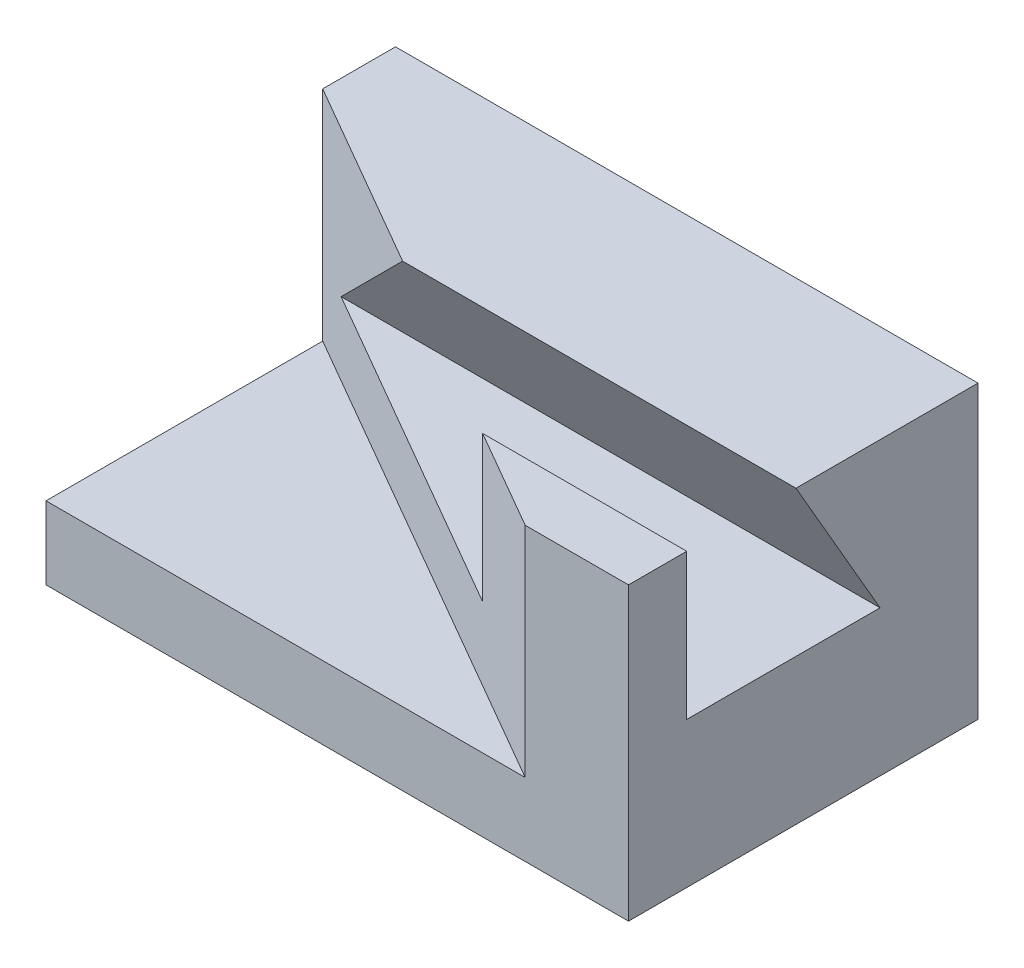
ISO-10303-21;
HEADER;
FILE_DESCRIPTION(('STEP AP214'),'2;1');
FILE_NAME('part.step','',(''),(''),'','','');
FILE_SCHEMA(('AUTOMOTIVE_DESIGN { 1 0 10303 214 1 1 1 1 }'));
ENDSEC;
DATA;
#1=APPLICATION_CONTEXT('core data for automotive mechanical design processes');
#2=APPLICATION_PROTOCOL_DEFINITION('international standard','automotive_design',2000,#1);
#3=PRODUCT_CONTEXT('',#1,'mechanical');
#4=PRODUCT('Part','Part','',(#3));
#5=PRODUCT_RELATED_PRODUCT_CATEGORY('part','',(#4));
#6=PRODUCT_DEFINITION_FORMATION('','',#4);
#7=PRODUCT_DEFINITION_CONTEXT('part definition',#1,'design');
#8=PRODUCT_DEFINITION('design','',#6,#7);
#9=PRODUCT_DEFINITION_SHAPE('','',#8);
#10=(LENGTH_UNIT() NAMED_UNIT(*) SI_UNIT(.MILLI.,.METRE.));
#11=(NAMED_UNIT(*) PLANE_ANGLE_UNIT() SI_UNIT($,.RADIAN.));
#12=(NAMED_UNIT(*) SI_UNIT($,.STERADIAN.) SOLID_ANGLE_UNIT());
#13=UNCERTAINTY_MEASURE_WITH_UNIT(LENGTH_MEASURE(1.E-05),#10,'distance_accuracy_value','');
#14=(GEOMETRIC_REPRESENTATION_CONTEXT(3) GLOBAL_UNCERTAINTY_ASSIGNED_CONTEXT((#13)) GLOBAL_UNIT_ASSIGNED_CONTEXT((#10,
#11,#12)) REPRESENTATION_CONTEXT('',''));
#15=CARTESIAN_POINT('',(0.,0.,0.));
#16=DIRECTION('',(0.,0.,1.));
#17=DIRECTION('',(1.,0.,0.));
#18=AXIS2_PLACEMENT_3D('',#15,#16,#17);
#19=CARTESIAN_POINT('',(0.,40.,0.));
#20=DIRECTION('',(0.,1.,0.));
#21=DIRECTION('',(0.,0.,1.));
#22=AXIS2_PLACEMENT_3D('',#19,#20,#21);
#23=PLANE('',#22);
#24=DIRECTION('',(1.,0.,0.));
#25=VECTOR('',#24,1.);
#26=CARTESIAN_POINT('',(-80.,40.,-23.));
#27=LINE('',#26,#25);
#28=CARTESIAN_POINT('',(-54.0192378864671,40.,-23.));
#29=VERTEX_POINT('',#28);
#30=CARTESIAN_POINT('',(0.,40.,-23.));
#31=VERTEX_POINT('',#30);
#32=EDGE_CURVE('E173',#29,#31,#27,.T.);
#33=ORIENTED_EDGE('',*,*,#32,.T.);
#34=DIRECTION('',(0.,0.,-1.));
#35=VECTOR('',#34,1.);
#36=CARTESIAN_POINT('',(0.,40.,0.));
#37=LINE('',#36,#35);
#38=CARTESIAN_POINT('',(0.,40.,-48.));
#39=VERTEX_POINT('',#38);
#40=EDGE_CURVE('E134',#31,#39,#37,.T.);
#41=ORIENTED_EDGE('',*,*,#40,.T.);
#42=DIRECTION('',(-1.,0.,0.));
#43=VECTOR('',#42,1.);
#44=CARTESIAN_POINT('',(0.,40.,-48.));
#45=LINE('',#44,#43);
#46=CARTESIAN_POINT('',(-80.,40.,-48.));
#47=VERTEX_POINT('',#46);
#48=EDGE_CURVE('E133',#39,#47,#45,.T.);
#49=ORIENTED_EDGE('',*,*,#48,.T.);
#50=DIRECTION('',(0.,0.,1.));
#51=VECTOR('',#50,1.);
#52=CARTESIAN_POINT('',(-80.,40.,0.));
#53=LINE('',#52,#51);
#54=CARTESIAN_POINT('',(-80.,40.,-38.));
#55=VERTEX_POINT('',#54);
#56=EDGE_CURVE('E136',#47,#55,#53,.T.);
#57=ORIENTED_EDGE('',*,*,#56,.T.);
#58=DIRECTION('',(-0.866025403784436,0.,-0.500000000000004));
#59=VECTOR('',#58,1.);
#60=CARTESIAN_POINT('',(-80.,40.,-38.));
#61=LINE('',#60,#59);
#62=EDGE_CURVE('E176',#29,#55,#61,.T.);
#63=ORIENTED_EDGE('',*,*,#62,.F.);
#64=EDGE_LOOP('',(#33,#41,#49,#57,#63));
#65=FACE_BOUND('',#64,.T.);
#66=ADVANCED_FACE('F33',(#65),#23,.T.);
#67=CARTESIAN_POINT('',(0.,40.,0.));
#68=DIRECTION('',(-1.,0.,0.));
#69=DIRECTION('',(0.,0.,1.));
#70=AXIS2_PLACEMENT_3D('',#67,#68,#69);
#71=PLANE('',#70);
#72=ORIENTED_EDGE('',*,*,#40,.F.);
#73=DIRECTION('',(0.,0.866025403784436,0.500000000000004));
#74=VECTOR('',#73,1.);
#75=CARTESIAN_POINT('',(0.,40.,-23.));
#76=LINE('',#75,#74);
#77=CARTESIAN_POINT('',(0.,20.,-34.5470053837926));
#78=VERTEX_POINT('',#77);
#79=EDGE_CURVE('E118',#78,#31,#76,.T.);
#80=ORIENTED_EDGE('',*,*,#79,.F.);
#81=DIRECTION('',(0.,0.,-1.));
#82=VECTOR('',#81,1.);
#83=CARTESIAN_POINT('',(0.,20.,-34.5470053837926));
#84=LINE('',#83,#82);
#85=CARTESIAN_POINT('',(0.,20.,-8.));
#86=VERTEX_POINT('',#85);
#87=EDGE_CURVE('E127',#86,#78,#84,.T.);
#88=ORIENTED_EDGE('',*,*,#87,.F.);
#89=DIRECTION('',(0.,-1.,0.));
#90=VECTOR('',#89,1.);
#91=CARTESIAN_POINT('',(0.,20.,-8.));
#92=LINE('',#91,#90);
#93=CARTESIAN_POINT('',(0.,40.,-8.));
#94=VERTEX_POINT('',#93);
#95=EDGE_CURVE('E112',#94,#86,#92,.T.);
#96=ORIENTED_EDGE('',*,*,#95,.F.);
#97=CARTESIAN_POINT('',(0.,40.,0.));
#98=VERTEX_POINT('',#97);
#99=EDGE_CURVE('E124',#98,#94,#37,.T.);
#100=ORIENTED_EDGE('',*,*,#99,.F.);
#101=DIRECTION('',(0.,-1.,0.));
#102=VECTOR('',#101,1.);
#103=CARTESIAN_POINT('',(0.,40.,0.));
#104=LINE('',#103,#102);
#105=CARTESIAN_POINT('',(0.,0.,0.));
#106=VERTEX_POINT('',#105);
#107=EDGE_CURVE('E145',#98,#106,#104,.T.);
#108=ORIENTED_EDGE('',*,*,#107,.T.);
#109=DIRECTION('',(0.,0.,-1.));
#110=VECTOR('',#109,1.);
#111=CARTESIAN_POINT('',(0.,0.,0.));
#112=LINE('',#111,#110);
#113=CARTESIAN_POINT('',(0.,0.,-48.));
#114=VERTEX_POINT('',#113);
#115=EDGE_CURVE('E146',#106,#114,#112,.T.);
#116=ORIENTED_EDGE('',*,*,#115,.T.);
#117=DIRECTION('',(0.,-1.,0.));
#118=VECTOR('',#117,1.);
#119=CARTESIAN_POINT('',(0.,40.,-48.));
#120=LINE('',#119,#118);
#121=EDGE_CURVE('E162',#39,#114,#120,.T.);
#122=ORIENTED_EDGE('',*,*,#121,.F.);
#123=EDGE_LOOP('',(#72,#80,#88,#96,#100,#108,#116,#122));
#124=FACE_BOUND('',#123,.T.);
#125=ADVANCED_FACE('F35',(#124),#71,.F.);
#126=CARTESIAN_POINT('',(0.,40.,-48.));
#127=DIRECTION('',(0.,0.,1.));
#128=DIRECTION('',(1.,0.,0.));
#129=AXIS2_PLACEMENT_3D('',#126,#127,#128);
#130=PLANE('',#129);
#131=DIRECTION('',(-1.,0.,0.));
#132=VECTOR('',#131,1.);
#133=CARTESIAN_POINT('',(0.,0.,-48.));
#134=LINE('',#133,#132);
#135=CARTESIAN_POINT('',(-80.,0.,-48.));
#136=VERTEX_POINT('',#135);
#137=EDGE_CURVE('E149',#114,#136,#134,.T.);
#138=ORIENTED_EDGE('',*,*,#137,.T.);
#139=DIRECTION('',(0.,-1.,0.));
#140=VECTOR('',#139,1.);
#141=CARTESIAN_POINT('',(-80.,40.,-48.));
#142=LINE('',#141,#140);
#143=EDGE_CURVE('E159',#47,#136,#142,.T.);
#144=ORIENTED_EDGE('',*,*,#143,.F.);
#145=ORIENTED_EDGE('',*,*,#48,.F.);
#146=ORIENTED_EDGE('',*,*,#121,.T.);
#147=EDGE_LOOP('',(#138,#144,#145,#146));
#148=FACE_BOUND('',#147,.T.);
#149=ADVANCED_FACE('F201',(#148),#130,.F.);
#150=CARTESIAN_POINT('',(-80.,40.,0.));
#151=DIRECTION('',(1.,0.,0.));
#152=DIRECTION('',(0.,0.,-1.));
#153=AXIS2_PLACEMENT_3D('',#150,#151,#152);
#154=PLANE('',#153);
#155=DIRECTION('',(0.,0.,1.));
#156=VECTOR('',#155,1.);
#157=CARTESIAN_POINT('',(-80.,10.,0.));
#158=LINE('',#157,#156);
#159=CARTESIAN_POINT('',(-80.,10.,-38.));
#160=VERTEX_POINT('',#159);
#161=CARTESIAN_POINT('',(-80.,10.,0.));
#162=VERTEX_POINT('',#161);
#163=EDGE_CURVE('E188',#160,#162,#158,.T.);
#164=ORIENTED_EDGE('',*,*,#163,.F.);
#165=DIRECTION('',(0.,1.,0.));
#166=VECTOR('',#165,1.);
#167=CARTESIAN_POINT('',(-80.,10.,-38.));
#168=LINE('',#167,#166);
#169=EDGE_CURVE('E150',#160,#55,#168,.T.);
#170=ORIENTED_EDGE('',*,*,#169,.T.);
#171=ORIENTED_EDGE('',*,*,#56,.F.);
#172=ORIENTED_EDGE('',*,*,#143,.T.);
#173=DIRECTION('',(0.,0.,1.));
#174=VECTOR('',#173,1.);
#175=CARTESIAN_POINT('',(-80.,0.,0.));
#176=LINE('',#175,#174);
#177=CARTESIAN_POINT('',(-80.,0.,0.));
#178=VERTEX_POINT('',#177);
#179=EDGE_CURVE('E152',#136,#178,#176,.T.);
#180=ORIENTED_EDGE('',*,*,#179,.T.);
#181=DIRECTION('',(0.,-1.,0.));
#182=VECTOR('',#181,1.);
#183=CARTESIAN_POINT('',(-80.,40.,0.));
#184=LINE('',#183,#182);
#185=EDGE_CURVE('E157',#162,#178,#184,.T.);
#186=ORIENTED_EDGE('',*,*,#185,.F.);
#187=EDGE_LOOP('',(#164,#170,#171,#172,#180,#186));
#188=FACE_BOUND('',#187,.T.);
#189=ADVANCED_FACE('F194',(#188),#154,.F.);
#190=CARTESIAN_POINT('',(0.,40.,0.));
#191=DIRECTION('',(0.,0.,-1.));
#192=DIRECTION('',(-1.,0.,0.));
#193=AXIS2_PLACEMENT_3D('',#190,#191,#192);
#194=PLANE('',#193);
#195=DIRECTION('',(1.,0.,0.));
#196=VECTOR('',#195,1.);
#197=CARTESIAN_POINT('',(0.,40.,0.));
#198=LINE('',#197,#196);
#199=CARTESIAN_POINT('',(-14.1820693123834,40.,0.));
#200=VERTEX_POINT('',#199);
#201=EDGE_CURVE('E131',#200,#98,#198,.T.);
#202=ORIENTED_EDGE('',*,*,#201,.F.);
#203=DIRECTION('',(0.,1.,0.));
#204=VECTOR('',#203,1.);
#205=CARTESIAN_POINT('',(-14.1820693123833,10.,0.));
#206=LINE('',#205,#204);
#207=CARTESIAN_POINT('',(-14.1820693123833,10.,0.));
#208=VERTEX_POINT('',#207);
#209=EDGE_CURVE('E56',#208,#200,#206,.T.);
#210=ORIENTED_EDGE('',*,*,#209,.F.);
#211=DIRECTION('',(1.,0.,0.));
#212=VECTOR('',#211,1.);
#213=CARTESIAN_POINT('',(-14.1820693123833,10.,0.));
#214=LINE('',#213,#212);
#215=EDGE_CURVE('E181',#162,#208,#214,.T.);
#216=ORIENTED_EDGE('',*,*,#215,.F.);
#217=ORIENTED_EDGE('',*,*,#185,.T.);
#218=DIRECTION('',(1.,0.,0.));
#219=VECTOR('',#218,1.);
#220=CARTESIAN_POINT('',(0.,0.,0.));
#221=LINE('',#220,#219);
#222=EDGE_CURVE('E138',#178,#106,#221,.T.);
#223=ORIENTED_EDGE('',*,*,#222,.T.);
#224=ORIENTED_EDGE('',*,*,#107,.F.);
#225=EDGE_LOOP('',(#202,#210,#216,#217,#223,#224));
#226=FACE_BOUND('',#225,.T.);
#227=ADVANCED_FACE('F208',(#226),#194,.F.);
#228=DIRECTION('',(1.,0.,0.));
#229=VECTOR('',#228,1.);
#230=CARTESIAN_POINT('',(-80.,40.,-8.));
#231=LINE('',#230,#229);
#232=CARTESIAN_POINT('',(-28.0384757729342,40.,-8.));
#233=VERTEX_POINT('',#232);
#234=EDGE_CURVE('E109',#233,#94,#231,.T.);
#235=ORIENTED_EDGE('',*,*,#234,.F.);
#236=EDGE_CURVE('E185',#200,#233,#61,.T.);
#237=ORIENTED_EDGE('',*,*,#236,.F.);
#238=ORIENTED_EDGE('',*,*,#201,.T.);
#239=ORIENTED_EDGE('',*,*,#99,.T.);
#240=EDGE_LOOP('',(#235,#237,#238,#239));
#241=FACE_BOUND('',#240,.T.);
#242=ADVANCED_FACE('F129',(#241),#23,.T.);
#243=CARTESIAN_POINT('',(0.,0.,0.));
#244=DIRECTION('',(0.,1.,0.));
#245=DIRECTION('',(0.,0.,1.));
#246=AXIS2_PLACEMENT_3D('',#243,#244,#245);
#247=PLANE('',#246);
#248=ORIENTED_EDGE('',*,*,#115,.F.);
#249=ORIENTED_EDGE('',*,*,#222,.F.);
#250=ORIENTED_EDGE('',*,*,#179,.F.);
#251=ORIENTED_EDGE('',*,*,#137,.F.);
#252=EDGE_LOOP('',(#248,#249,#250,#251));
#253=FACE_BOUND('',#252,.T.);
#254=ADVANCED_FACE('F206',(#253),#247,.F.);
#255=CARTESIAN_POINT('',(-80.,10.,-38.));
#256=DIRECTION('',(0.500000000000004,0.,-0.866025403784436));
#257=DIRECTION('',(-0.866025403784436,0.,-0.500000000000004));
#258=AXIS2_PLACEMENT_3D('',#255,#256,#257);
#259=PLANE('',#258);
#260=DIRECTION('',(-0.866025403784436,0.,-0.500000000000004));
#261=VECTOR('',#260,1.);
#262=CARTESIAN_POINT('',(-80.,20.,-38.));
#263=LINE('',#262,#261);
#264=CARTESIAN_POINT('',(-28.0384757729342,20.,-8.));
#265=VERTEX_POINT('',#264);
#266=CARTESIAN_POINT('',(-74.0192378864671,20.,-34.5470053837926));
#267=VERTEX_POINT('',#266);
#268=EDGE_CURVE('E41',#265,#267,#263,.T.);
#269=ORIENTED_EDGE('',*,*,#268,.T.);
#270=DIRECTION('',(0.654653670707977,0.654653670707976,0.377964473009231));
#271=VECTOR('',#270,1.);
#272=CARTESIAN_POINT('',(-81.7225305227716,12.2967073636955,-38.9945034610096));
#273=LINE('',#272,#271);
#274=EDGE_CURVE('E11',#267,#29,#273,.T.);
#275=ORIENTED_EDGE('',*,*,#274,.T.);
#276=ORIENTED_EDGE('',*,*,#62,.T.);
#277=ORIENTED_EDGE('',*,*,#169,.F.);
#278=DIRECTION('',(-0.866025403784436,0.,-0.500000000000004));
#279=VECTOR('',#278,1.);
#280=CARTESIAN_POINT('',(-80.,10.,-38.));
#281=LINE('',#280,#279);
#282=EDGE_CURVE('E184',#208,#160,#281,.T.);
#283=ORIENTED_EDGE('',*,*,#282,.F.);
#284=ORIENTED_EDGE('',*,*,#209,.T.);
#285=ORIENTED_EDGE('',*,*,#236,.T.);
#286=DIRECTION('',(0.,-1.,0.));
#287=VECTOR('',#286,1.);
#288=CARTESIAN_POINT('',(-28.0384757729342,10.,-8.));
#289=LINE('',#288,#287);
#290=EDGE_CURVE('E115',#233,#265,#289,.T.);
#291=ORIENTED_EDGE('',*,*,#290,.T.);
#292=EDGE_LOOP('',(#269,#275,#276,#277,#283,#284,#285,#291));
#293=FACE_BOUND('',#292,.T.);
#294=ADVANCED_FACE('F166',(#293),#259,.F.);
#295=CARTESIAN_POINT('',(0.,10.,0.));
#296=DIRECTION('',(0.,-1.,0.));
#297=DIRECTION('',(0.,0.,-1.));
#298=AXIS2_PLACEMENT_3D('',#295,#296,#297);
#299=PLANE('',#298);
#300=ORIENTED_EDGE('',*,*,#215,.T.);
#301=ORIENTED_EDGE('',*,*,#282,.T.);
#302=ORIENTED_EDGE('',*,*,#163,.T.);
#303=EDGE_LOOP('',(#300,#301,#302));
#304=FACE_BOUND('',#303,.T.);
#305=ADVANCED_FACE('F213',(#304),#299,.F.);
#306=CARTESIAN_POINT('',(-80.,40.,-23.));
#307=DIRECTION('',(0.,0.500000000000004,-0.866025403784436));
#308=DIRECTION('',(0.,0.866025403784436,0.500000000000004));
#309=AXIS2_PLACEMENT_3D('',#306,#307,#308);
#310=PLANE('',#309);
#311=DIRECTION('',(1.,0.,0.));
#312=VECTOR('',#311,1.);
#313=CARTESIAN_POINT('',(-80.,20.,-34.5470053837926));
#314=LINE('',#313,#312);
#315=EDGE_CURVE('E171',#267,#78,#314,.T.);
#316=ORIENTED_EDGE('',*,*,#315,.T.);
#317=ORIENTED_EDGE('',*,*,#79,.T.);
#318=ORIENTED_EDGE('',*,*,#32,.F.);
#319=ORIENTED_EDGE('',*,*,#274,.F.);
#320=EDGE_LOOP('',(#316,#317,#318,#319));
#321=FACE_BOUND('',#320,.T.);
#322=ADVANCED_FACE('F211',(#321),#310,.F.);
#323=CARTESIAN_POINT('',(-80.,20.,-34.5470053837926));
#324=DIRECTION('',(0.,-1.,0.));
#325=DIRECTION('',(0.,0.,-1.));
#326=AXIS2_PLACEMENT_3D('',#323,#324,#325);
#327=PLANE('',#326);
#328=DIRECTION('',(1.,0.,0.));
#329=VECTOR('',#328,1.);
#330=CARTESIAN_POINT('',(-80.,20.,-8.));
#331=LINE('',#330,#329);
#332=EDGE_CURVE('E48',#265,#86,#331,.T.);
#333=ORIENTED_EDGE('',*,*,#332,.T.);
#334=ORIENTED_EDGE('',*,*,#87,.T.);
#335=ORIENTED_EDGE('',*,*,#315,.F.);
#336=ORIENTED_EDGE('',*,*,#268,.F.);
#337=EDGE_LOOP('',(#333,#334,#335,#336));
#338=FACE_BOUND('',#337,.T.);
#339=ADVANCED_FACE('F170',(#338),#327,.F.);
#340=CARTESIAN_POINT('',(-80.,20.,-8.));
#341=DIRECTION('',(0.,0.,1.));
#342=DIRECTION('',(1.,0.,0.));
#343=AXIS2_PLACEMENT_3D('',#340,#341,#342);
#344=PLANE('',#343);
#345=ORIENTED_EDGE('',*,*,#234,.T.);
#346=ORIENTED_EDGE('',*,*,#95,.T.);
#347=ORIENTED_EDGE('',*,*,#332,.F.);
#348=ORIENTED_EDGE('',*,*,#290,.F.);
#349=EDGE_LOOP('',(#345,#346,#347,#348));
#350=FACE_BOUND('',#349,.T.);
#351=ADVANCED_FACE('F111',(#350),#344,.F.);
#352=CLOSED_SHELL('',(#66,#125,#149,#189,#227,#242,#254,#294,#305,#322,#339,#351));
#353=MANIFOLD_SOLID_BREP('B2',#352);
#354=ADVANCED_BREP_SHAPE_REPRESENTATION('',(#18,#353),#14);
#355=SHAPE_DEFINITION_REPRESENTATION(#9,#354);
ENDSEC;
END-ISO-10303-21;
